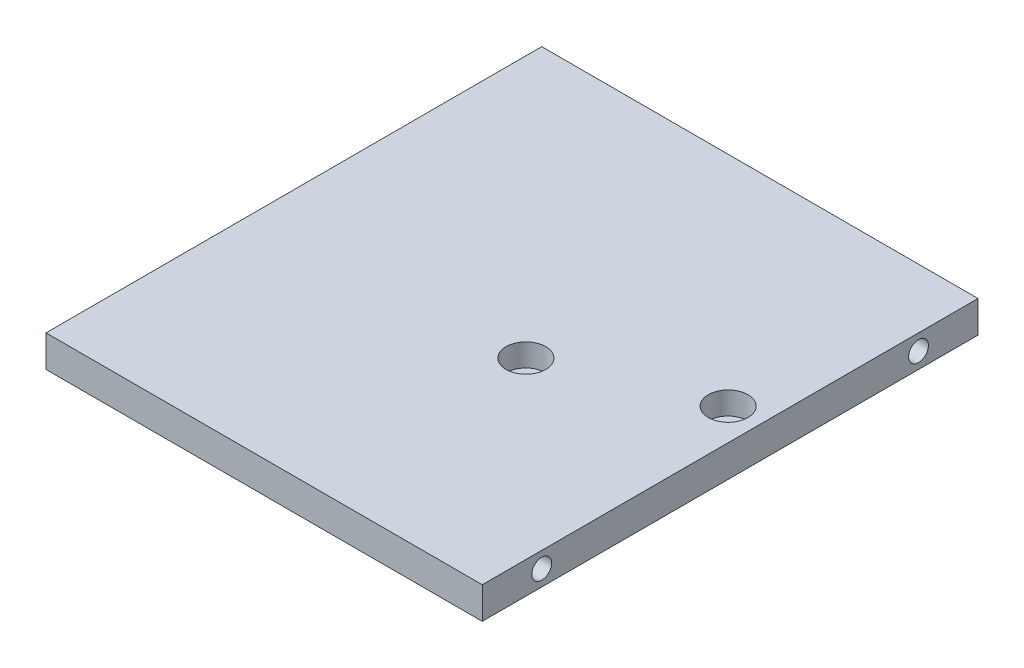
ISO-10303-21;
HEADER;
FILE_DESCRIPTION(('STEP AP214'),'2;1');
FILE_NAME('part.step','',(''),(''),'','','');
FILE_SCHEMA(('AUTOMOTIVE_DESIGN { 1 0 10303 214 1 1 1 1 }'));
ENDSEC;
DATA;
#1=APPLICATION_CONTEXT('core data for automotive mechanical design processes');
#2=APPLICATION_PROTOCOL_DEFINITION('international standard','automotive_design',2000,#1);
#3=PRODUCT_CONTEXT('',#1,'mechanical');
#4=PRODUCT('Part','Part','',(#3));
#5=PRODUCT_RELATED_PRODUCT_CATEGORY('part','',(#4));
#6=PRODUCT_DEFINITION_FORMATION('','',#4);
#7=PRODUCT_DEFINITION_CONTEXT('part definition',#1,'design');
#8=PRODUCT_DEFINITION('design','',#6,#7);
#9=PRODUCT_DEFINITION_SHAPE('','',#8);
#10=(LENGTH_UNIT() NAMED_UNIT(*) SI_UNIT(.MILLI.,.METRE.));
#11=(NAMED_UNIT(*) PLANE_ANGLE_UNIT() SI_UNIT($,.RADIAN.));
#12=(NAMED_UNIT(*) SI_UNIT($,.STERADIAN.) SOLID_ANGLE_UNIT());
#13=UNCERTAINTY_MEASURE_WITH_UNIT(LENGTH_MEASURE(1.E-05),#10,'distance_accuracy_value','');
#14=(GEOMETRIC_REPRESENTATION_CONTEXT(3) GLOBAL_UNCERTAINTY_ASSIGNED_CONTEXT((#13)) GLOBAL_UNIT_ASSIGNED_CONTEXT((#10,
#11,#12)) REPRESENTATION_CONTEXT('',''));
#15=CARTESIAN_POINT('',(0.,0.,0.));
#16=DIRECTION('',(0.,0.,1.));
#17=DIRECTION('',(1.,0.,0.));
#18=AXIS2_PLACEMENT_3D('',#15,#16,#17);
#19=CARTESIAN_POINT('',(11.,0.,7.49999999999999));
#20=DIRECTION('',(0.,1.,0.));
#21=DIRECTION('',(0.,0.,1.));
#22=AXIS2_PLACEMENT_3D('',#19,#20,#21);
#23=CYLINDRICAL_SURFACE('',#22,2.75);
#24=CARTESIAN_POINT('',(11.,0.,7.49999999999999));
#25=DIRECTION('',(0.,1.,0.));
#26=DIRECTION('',(0.,0.,1.));
#27=AXIS2_PLACEMENT_3D('',#24,#25,#26);
#28=CIRCLE('',#27,2.75);
#29=CARTESIAN_POINT('',(11.,0.,10.25));
#30=VERTEX_POINT('',#29);
#31=EDGE_CURVE('E144',#30,#30,#28,.T.);
#32=ORIENTED_EDGE('',*,*,#31,.F.);
#33=EDGE_LOOP('',(#32));
#34=FACE_BOUND('',#33,.T.);
#35=CARTESIAN_POINT('',(11.,2.3,7.49999999999999));
#36=DIRECTION('',(0.,1.,0.));
#37=DIRECTION('',(0.,0.,1.));
#38=AXIS2_PLACEMENT_3D('',#35,#36,#37);
#39=CIRCLE('',#38,2.75);
#40=CARTESIAN_POINT('',(11.,2.3,10.25));
#41=VERTEX_POINT('',#40);
#42=EDGE_CURVE('E37',#41,#41,#39,.F.);
#43=ORIENTED_EDGE('',*,*,#42,.F.);
#44=EDGE_LOOP('',(#43));
#45=FACE_BOUND('',#44,.T.);
#46=ADVANCED_FACE('F33',(#34,#45),#23,.F.);
#47=CARTESIAN_POINT('',(47.,0.,-7.50000000000002));
#48=DIRECTION('',(0.,1.,0.));
#49=DIRECTION('',(0.,0.,1.));
#50=AXIS2_PLACEMENT_3D('',#47,#48,#49);
#51=CYLINDRICAL_SURFACE('',#50,2.75);
#52=CARTESIAN_POINT('',(47.,0.,-7.50000000000002));
#53=DIRECTION('',(0.,1.,0.));
#54=DIRECTION('',(0.,0.,1.));
#55=AXIS2_PLACEMENT_3D('',#52,#53,#54);
#56=CIRCLE('',#55,2.75);
#57=CARTESIAN_POINT('',(47.,0.,-4.75000000000002));
#58=VERTEX_POINT('',#57);
#59=EDGE_CURVE('E103',#58,#58,#56,.T.);
#60=ORIENTED_EDGE('',*,*,#59,.F.);
#61=EDGE_LOOP('',(#60));
#62=FACE_BOUND('',#61,.T.);
#63=CARTESIAN_POINT('',(47.,2.3,-7.50000000000002));
#64=DIRECTION('',(0.,1.,0.));
#65=DIRECTION('',(0.,0.,1.));
#66=AXIS2_PLACEMENT_3D('',#63,#64,#65);
#67=CIRCLE('',#66,2.75);
#68=CARTESIAN_POINT('',(47.,2.3,-4.75000000000002));
#69=VERTEX_POINT('',#68);
#70=EDGE_CURVE('E108',#69,#69,#67,.F.);
#71=ORIENTED_EDGE('',*,*,#70,.F.);
#72=EDGE_LOOP('',(#71));
#73=FACE_BOUND('',#72,.T.);
#74=ADVANCED_FACE('F163',(#62,#73),#51,.F.);
#75=CARTESIAN_POINT('',(55.,8.,-62.5));
#76=DIRECTION('',(-1.,0.,0.));
#77=DIRECTION('',(0.,0.,1.));
#78=AXIS2_PLACEMENT_3D('',#75,#76,#77);
#79=PLANE('',#78);
#80=CARTESIAN_POINT('',(55.,4.,-47.5));
#81=DIRECTION('',(1.,0.,0.));
#82=DIRECTION('',(0.,0.,-1.));
#83=AXIS2_PLACEMENT_3D('',#80,#81,#82);
#84=CIRCLE('',#83,2.5);
#85=CARTESIAN_POINT('',(55.,4.,-50.));
#86=VERTEX_POINT('',#85);
#87=EDGE_CURVE('E133',#86,#86,#84,.T.);
#88=ORIENTED_EDGE('',*,*,#87,.F.);
#89=EDGE_LOOP('',(#88));
#90=FACE_BOUND('',#89,.T.);
#91=CARTESIAN_POINT('',(55.,4.,47.5));
#92=DIRECTION('',(1.,0.,0.));
#93=DIRECTION('',(0.,0.,-1.));
#94=AXIS2_PLACEMENT_3D('',#91,#92,#93);
#95=CIRCLE('',#94,2.49999999999999);
#96=CARTESIAN_POINT('',(55.,4.,45.));
#97=VERTEX_POINT('',#96);
#98=EDGE_CURVE('E114',#97,#97,#95,.T.);
#99=ORIENTED_EDGE('',*,*,#98,.F.);
#100=EDGE_LOOP('',(#99));
#101=FACE_BOUND('',#100,.T.);
#102=DIRECTION('',(0.,0.,-1.));
#103=VECTOR('',#102,1.);
#104=CARTESIAN_POINT('',(55.,0.,-62.5));
#105=LINE('',#104,#103);
#106=CARTESIAN_POINT('',(55.,0.,62.5));
#107=VERTEX_POINT('',#106);
#108=CARTESIAN_POINT('',(55.,0.,-62.5));
#109=VERTEX_POINT('',#108);
#110=EDGE_CURVE('E100',#107,#109,#105,.T.);
#111=ORIENTED_EDGE('',*,*,#110,.T.);
#112=DIRECTION('',(0.,-1.,0.));
#113=VECTOR('',#112,1.);
#114=CARTESIAN_POINT('',(55.,8.,-62.5));
#115=LINE('',#114,#113);
#116=CARTESIAN_POINT('',(55.,8.,-62.5));
#117=VERTEX_POINT('',#116);
#118=EDGE_CURVE('E11',#117,#109,#115,.T.);
#119=ORIENTED_EDGE('',*,*,#118,.F.);
#120=DIRECTION('',(0.,0.,-1.));
#121=VECTOR('',#120,1.);
#122=CARTESIAN_POINT('',(55.,8.,-62.5));
#123=LINE('',#122,#121);
#124=CARTESIAN_POINT('',(55.,8.,62.5));
#125=VERTEX_POINT('',#124);
#126=EDGE_CURVE('E87',#125,#117,#123,.T.);
#127=ORIENTED_EDGE('',*,*,#126,.F.);
#128=DIRECTION('',(0.,-1.,0.));
#129=VECTOR('',#128,1.);
#130=CARTESIAN_POINT('',(55.,8.,62.5));
#131=LINE('',#130,#129);
#132=EDGE_CURVE('E96',#125,#107,#131,.T.);
#133=ORIENTED_EDGE('',*,*,#132,.T.);
#134=EDGE_LOOP('',(#111,#119,#127,#133));
#135=FACE_BOUND('',#134,.T.);
#136=ADVANCED_FACE('F35',(#90,#101,#135),#79,.F.);
#137=CARTESIAN_POINT('',(-55.,8.,-62.5));
#138=DIRECTION('',(0.,0.,1.));
#139=DIRECTION('',(1.,0.,0.));
#140=AXIS2_PLACEMENT_3D('',#137,#138,#139);
#141=PLANE('',#140);
#142=DIRECTION('',(-1.,0.,0.));
#143=VECTOR('',#142,1.);
#144=CARTESIAN_POINT('',(-55.,0.,-62.5));
#145=LINE('',#144,#143);
#146=CARTESIAN_POINT('',(-55.,0.,-62.5));
#147=VERTEX_POINT('',#146);
#148=EDGE_CURVE('E91',#109,#147,#145,.T.);
#149=ORIENTED_EDGE('',*,*,#148,.T.);
#150=DIRECTION('',(0.,-1.,0.));
#151=VECTOR('',#150,1.);
#152=CARTESIAN_POINT('',(-55.,8.,-62.5));
#153=LINE('',#152,#151);
#154=CARTESIAN_POINT('',(-55.,8.,-62.5));
#155=VERTEX_POINT('',#154);
#156=EDGE_CURVE('E43',#155,#147,#153,.T.);
#157=ORIENTED_EDGE('',*,*,#156,.F.);
#158=DIRECTION('',(-1.,0.,0.));
#159=VECTOR('',#158,1.);
#160=CARTESIAN_POINT('',(-55.,8.,-62.5));
#161=LINE('',#160,#159);
#162=EDGE_CURVE('E82',#117,#155,#161,.T.);
#163=ORIENTED_EDGE('',*,*,#162,.F.);
#164=ORIENTED_EDGE('',*,*,#118,.T.);
#165=EDGE_LOOP('',(#149,#157,#163,#164));
#166=FACE_BOUND('',#165,.T.);
#167=ADVANCED_FACE('F90',(#166),#141,.F.);
#168=CARTESIAN_POINT('',(-55.,8.,-62.5));
#169=DIRECTION('',(1.,0.,0.));
#170=DIRECTION('',(0.,0.,-1.));
#171=AXIS2_PLACEMENT_3D('',#168,#169,#170);
#172=PLANE('',#171);
#173=CARTESIAN_POINT('',(-55.,4.,47.5));
#174=DIRECTION('',(-1.,0.,0.));
#175=DIRECTION('',(0.,0.,1.));
#176=AXIS2_PLACEMENT_3D('',#173,#174,#175);
#177=CIRCLE('',#176,2.5);
#178=CARTESIAN_POINT('',(-55.,4.,50.));
#179=VERTEX_POINT('',#178);
#180=EDGE_CURVE('E145',#179,#179,#177,.T.);
#181=ORIENTED_EDGE('',*,*,#180,.F.);
#182=EDGE_LOOP('',(#181));
#183=FACE_BOUND('',#182,.T.);
#184=CARTESIAN_POINT('',(-55.,4.,-47.5));
#185=DIRECTION('',(-1.,0.,0.));
#186=DIRECTION('',(0.,0.,1.));
#187=AXIS2_PLACEMENT_3D('',#184,#185,#186);
#188=CIRCLE('',#187,2.5);
#189=CARTESIAN_POINT('',(-55.,4.,-45.));
#190=VERTEX_POINT('',#189);
#191=EDGE_CURVE('E132',#190,#190,#188,.T.);
#192=ORIENTED_EDGE('',*,*,#191,.F.);
#193=EDGE_LOOP('',(#192));
#194=FACE_BOUND('',#193,.T.);
#195=DIRECTION('',(0.,0.,1.));
#196=VECTOR('',#195,1.);
#197=CARTESIAN_POINT('',(-55.,0.,-62.5));
#198=LINE('',#197,#196);
#199=CARTESIAN_POINT('',(-55.,0.,62.5));
#200=VERTEX_POINT('',#199);
#201=EDGE_CURVE('E69',#147,#200,#198,.T.);
#202=ORIENTED_EDGE('',*,*,#201,.T.);
#203=DIRECTION('',(0.,-1.,0.));
#204=VECTOR('',#203,1.);
#205=CARTESIAN_POINT('',(-55.,8.,62.5));
#206=LINE('',#205,#204);
#207=CARTESIAN_POINT('',(-55.,8.,62.5));
#208=VERTEX_POINT('',#207);
#209=EDGE_CURVE('E92',#208,#200,#206,.T.);
#210=ORIENTED_EDGE('',*,*,#209,.F.);
#211=DIRECTION('',(0.,0.,1.));
#212=VECTOR('',#211,1.);
#213=CARTESIAN_POINT('',(-55.,8.,-62.5));
#214=LINE('',#213,#212);
#215=EDGE_CURVE('E85',#155,#208,#214,.T.);
#216=ORIENTED_EDGE('',*,*,#215,.F.);
#217=ORIENTED_EDGE('',*,*,#156,.T.);
#218=EDGE_LOOP('',(#202,#210,#216,#217));
#219=FACE_BOUND('',#218,.T.);
#220=ADVANCED_FACE('F94',(#183,#194,#219),#172,.F.);
#221=CARTESIAN_POINT('',(-55.,8.,62.5));
#222=DIRECTION('',(0.,0.,-1.));
#223=DIRECTION('',(-1.,0.,0.));
#224=AXIS2_PLACEMENT_3D('',#221,#222,#223);
#225=PLANE('',#224);
#226=DIRECTION('',(1.,0.,0.));
#227=VECTOR('',#226,1.);
#228=CARTESIAN_POINT('',(-55.,0.,62.5));
#229=LINE('',#228,#227);
#230=EDGE_CURVE('E75',#200,#107,#229,.T.);
#231=ORIENTED_EDGE('',*,*,#230,.T.);
#232=ORIENTED_EDGE('',*,*,#132,.F.);
#233=DIRECTION('',(1.,0.,0.));
#234=VECTOR('',#233,1.);
#235=CARTESIAN_POINT('',(-55.,8.,62.5));
#236=LINE('',#235,#234);
#237=EDGE_CURVE('E52',#208,#125,#236,.T.);
#238=ORIENTED_EDGE('',*,*,#237,.F.);
#239=ORIENTED_EDGE('',*,*,#209,.T.);
#240=EDGE_LOOP('',(#231,#232,#238,#239));
#241=FACE_BOUND('',#240,.T.);
#242=ADVANCED_FACE('F222',(#241),#225,.F.);
#243=CARTESIAN_POINT('',(0.,8.,0.));
#244=DIRECTION('',(0.,1.,0.));
#245=DIRECTION('',(0.,0.,1.));
#246=AXIS2_PLACEMENT_3D('',#243,#244,#245);
#247=PLANE('',#246);
#248=CARTESIAN_POINT('',(11.,8.,7.49999999999999));
#249=DIRECTION('',(0.,1.,0.));
#250=DIRECTION('',(0.,0.,1.));
#251=AXIS2_PLACEMENT_3D('',#248,#249,#250);
#252=CIRCLE('',#251,5.);
#253=CARTESIAN_POINT('',(11.,8.,12.5));
#254=VERTEX_POINT('',#253);
#255=EDGE_CURVE('E116',#254,#254,#252,.T.);
#256=ORIENTED_EDGE('',*,*,#255,.F.);
#257=EDGE_LOOP('',(#256));
#258=FACE_BOUND('',#257,.T.);
#259=CARTESIAN_POINT('',(47.,8.,-7.50000000000002));
#260=DIRECTION('',(0.,1.,0.));
#261=DIRECTION('',(0.,0.,1.));
#262=AXIS2_PLACEMENT_3D('',#259,#260,#261);
#263=CIRCLE('',#262,5.);
#264=CARTESIAN_POINT('',(47.,8.,-2.50000000000002));
#265=VERTEX_POINT('',#264);
#266=EDGE_CURVE('E126',#265,#265,#263,.T.);
#267=ORIENTED_EDGE('',*,*,#266,.F.);
#268=EDGE_LOOP('',(#267));
#269=FACE_BOUND('',#268,.T.);
#270=ORIENTED_EDGE('',*,*,#126,.T.);
#271=ORIENTED_EDGE('',*,*,#162,.T.);
#272=ORIENTED_EDGE('',*,*,#215,.T.);
#273=ORIENTED_EDGE('',*,*,#237,.T.);
#274=EDGE_LOOP('',(#270,#271,#272,#273));
#275=FACE_BOUND('',#274,.T.);
#276=ADVANCED_FACE('F83',(#258,#269,#275),#247,.T.);
#277=CARTESIAN_POINT('',(0.,0.,0.));
#278=DIRECTION('',(0.,1.,0.));
#279=DIRECTION('',(0.,0.,1.));
#280=AXIS2_PLACEMENT_3D('',#277,#278,#279);
#281=PLANE('',#280);
#282=ORIENTED_EDGE('',*,*,#59,.T.);
#283=EDGE_LOOP('',(#282));
#284=FACE_BOUND('',#283,.T.);
#285=ORIENTED_EDGE('',*,*,#31,.T.);
#286=EDGE_LOOP('',(#285));
#287=FACE_BOUND('',#286,.T.);
#288=ORIENTED_EDGE('',*,*,#110,.F.);
#289=ORIENTED_EDGE('',*,*,#230,.F.);
#290=ORIENTED_EDGE('',*,*,#201,.F.);
#291=ORIENTED_EDGE('',*,*,#148,.F.);
#292=EDGE_LOOP('',(#288,#289,#290,#291));
#293=FACE_BOUND('',#292,.T.);
#294=ADVANCED_FACE('F158',(#284,#287,#293),#281,.F.);
#295=CARTESIAN_POINT('',(-40.,4.,-47.5));
#296=DIRECTION('',(-1.,0.,0.));
#297=DIRECTION('',(0.,0.,1.));
#298=AXIS2_PLACEMENT_3D('',#295,#296,#297);
#299=CYLINDRICAL_SURFACE('',#298,2.5);
#300=CARTESIAN_POINT('',(-40.,4.,-47.5));
#301=DIRECTION('',(-1.,0.,0.));
#302=DIRECTION('',(0.,0.,1.));
#303=AXIS2_PLACEMENT_3D('',#300,#301,#302);
#304=CIRCLE('',#303,2.5);
#305=CARTESIAN_POINT('',(-40.,4.,-45.));
#306=VERTEX_POINT('',#305);
#307=EDGE_CURVE('E148',#306,#306,#304,.T.);
#308=ORIENTED_EDGE('',*,*,#307,.F.);
#309=EDGE_LOOP('',(#308));
#310=FACE_BOUND('',#309,.T.);
#311=ORIENTED_EDGE('',*,*,#191,.T.);
#312=EDGE_LOOP('',(#311));
#313=FACE_BOUND('',#312,.T.);
#314=ADVANCED_FACE('F212',(#310,#313),#299,.F.);
#315=CARTESIAN_POINT('',(-40.,4.,-47.5));
#316=DIRECTION('',(-1.,0.,0.));
#317=DIRECTION('',(0.,0.,1.));
#318=AXIS2_PLACEMENT_3D('',#315,#316,#317);
#319=PLANE('',#318);
#320=ORIENTED_EDGE('',*,*,#307,.T.);
#321=EDGE_LOOP('',(#320));
#322=FACE_BOUND('',#321,.T.);
#323=ADVANCED_FACE('F208',(#322),#319,.T.);
#324=CARTESIAN_POINT('',(-40.,4.,47.5));
#325=DIRECTION('',(-1.,0.,0.));
#326=DIRECTION('',(0.,0.,1.));
#327=AXIS2_PLACEMENT_3D('',#324,#325,#326);
#328=CYLINDRICAL_SURFACE('',#327,2.5);
#329=CARTESIAN_POINT('',(-40.,4.,47.5));
#330=DIRECTION('',(-1.,0.,0.));
#331=DIRECTION('',(0.,0.,1.));
#332=AXIS2_PLACEMENT_3D('',#329,#330,#331);
#333=CIRCLE('',#332,2.5);
#334=CARTESIAN_POINT('',(-40.,4.,50.));
#335=VERTEX_POINT('',#334);
#336=EDGE_CURVE('E141',#335,#335,#333,.T.);
#337=ORIENTED_EDGE('',*,*,#336,.F.);
#338=EDGE_LOOP('',(#337));
#339=FACE_BOUND('',#338,.T.);
#340=ORIENTED_EDGE('',*,*,#180,.T.);
#341=EDGE_LOOP('',(#340));
#342=FACE_BOUND('',#341,.T.);
#343=ADVANCED_FACE('F204',(#339,#342),#328,.F.);
#344=CARTESIAN_POINT('',(-40.,4.,47.5));
#345=DIRECTION('',(-1.,0.,0.));
#346=DIRECTION('',(0.,0.,1.));
#347=AXIS2_PLACEMENT_3D('',#344,#345,#346);
#348=PLANE('',#347);
#349=ORIENTED_EDGE('',*,*,#336,.T.);
#350=EDGE_LOOP('',(#349));
#351=FACE_BOUND('',#350,.T.);
#352=ADVANCED_FACE('F200',(#351),#348,.T.);
#353=CARTESIAN_POINT('',(40.,4.,47.5));
#354=DIRECTION('',(1.,0.,0.));
#355=DIRECTION('',(0.,0.,-1.));
#356=AXIS2_PLACEMENT_3D('',#353,#354,#355);
#357=CYLINDRICAL_SURFACE('',#356,2.49999999999999);
#358=CARTESIAN_POINT('',(40.,4.,47.5));
#359=DIRECTION('',(1.,0.,0.));
#360=DIRECTION('',(0.,0.,-1.));
#361=AXIS2_PLACEMENT_3D('',#358,#359,#360);
#362=CIRCLE('',#361,2.49999999999999);
#363=CARTESIAN_POINT('',(40.,4.,45.));
#364=VERTEX_POINT('',#363);
#365=EDGE_CURVE('E136',#364,#364,#362,.T.);
#366=ORIENTED_EDGE('',*,*,#365,.F.);
#367=EDGE_LOOP('',(#366));
#368=FACE_BOUND('',#367,.T.);
#369=ORIENTED_EDGE('',*,*,#98,.T.);
#370=EDGE_LOOP('',(#369));
#371=FACE_BOUND('',#370,.T.);
#372=ADVANCED_FACE('F196',(#368,#371),#357,.F.);
#373=CARTESIAN_POINT('',(40.,4.,47.5));
#374=DIRECTION('',(1.,0.,0.));
#375=DIRECTION('',(0.,0.,-1.));
#376=AXIS2_PLACEMENT_3D('',#373,#374,#375);
#377=PLANE('',#376);
#378=ORIENTED_EDGE('',*,*,#365,.T.);
#379=EDGE_LOOP('',(#378));
#380=FACE_BOUND('',#379,.T.);
#381=ADVANCED_FACE('F192',(#380),#377,.T.);
#382=CARTESIAN_POINT('',(40.,4.,-47.5));
#383=DIRECTION('',(1.,0.,0.));
#384=DIRECTION('',(0.,0.,-1.));
#385=AXIS2_PLACEMENT_3D('',#382,#383,#384);
#386=CYLINDRICAL_SURFACE('',#385,2.5);
#387=CARTESIAN_POINT('',(40.,4.,-47.5));
#388=DIRECTION('',(1.,0.,0.));
#389=DIRECTION('',(0.,0.,-1.));
#390=AXIS2_PLACEMENT_3D('',#387,#388,#389);
#391=CIRCLE('',#390,2.5);
#392=CARTESIAN_POINT('',(40.,4.,-50.));
#393=VERTEX_POINT('',#392);
#394=EDGE_CURVE('E129',#393,#393,#391,.T.);
#395=ORIENTED_EDGE('',*,*,#394,.F.);
#396=EDGE_LOOP('',(#395));
#397=FACE_BOUND('',#396,.T.);
#398=ORIENTED_EDGE('',*,*,#87,.T.);
#399=EDGE_LOOP('',(#398));
#400=FACE_BOUND('',#399,.T.);
#401=ADVANCED_FACE('F188',(#397,#400),#386,.F.);
#402=CARTESIAN_POINT('',(40.,4.,-47.5));
#403=DIRECTION('',(1.,0.,0.));
#404=DIRECTION('',(0.,0.,-1.));
#405=AXIS2_PLACEMENT_3D('',#402,#403,#404);
#406=PLANE('',#405);
#407=ORIENTED_EDGE('',*,*,#394,.T.);
#408=EDGE_LOOP('',(#407));
#409=FACE_BOUND('',#408,.T.);
#410=ADVANCED_FACE('F183',(#409),#406,.T.);
#411=CARTESIAN_POINT('',(47.,2.3,-7.50000000000002));
#412=DIRECTION('',(0.,1.,0.));
#413=DIRECTION('',(0.,0.,1.));
#414=AXIS2_PLACEMENT_3D('',#411,#412,#413);
#415=PLANE('',#414);
#416=CARTESIAN_POINT('',(47.,2.3,-7.50000000000002));
#417=DIRECTION('',(0.,1.,0.));
#418=DIRECTION('',(0.,0.,1.));
#419=AXIS2_PLACEMENT_3D('',#416,#417,#418);
#420=CIRCLE('',#419,5.);
#421=CARTESIAN_POINT('',(47.,2.3,-2.50000000000002));
#422=VERTEX_POINT('',#421);
#423=EDGE_CURVE('E121',#422,#422,#420,.T.);
#424=ORIENTED_EDGE('',*,*,#423,.T.);
#425=EDGE_LOOP('',(#424));
#426=FACE_BOUND('',#425,.T.);
#427=ORIENTED_EDGE('',*,*,#70,.T.);
#428=EDGE_LOOP('',(#427));
#429=FACE_BOUND('',#428,.T.);
#430=ADVANCED_FACE('F178',(#426,#429),#415,.T.);
#431=CARTESIAN_POINT('',(47.,2.3,-7.50000000000002));
#432=DIRECTION('',(0.,1.,0.));
#433=DIRECTION('',(0.,0.,1.));
#434=AXIS2_PLACEMENT_3D('',#431,#432,#433);
#435=CYLINDRICAL_SURFACE('',#434,5.);
#436=ORIENTED_EDGE('',*,*,#423,.F.);
#437=EDGE_LOOP('',(#436));
#438=FACE_BOUND('',#437,.T.);
#439=ORIENTED_EDGE('',*,*,#266,.T.);
#440=EDGE_LOOP('',(#439));
#441=FACE_BOUND('',#440,.T.);
#442=ADVANCED_FACE('F170',(#438,#441),#435,.F.);
#443=CARTESIAN_POINT('',(11.,2.3,7.49999999999999));
#444=DIRECTION('',(0.,1.,0.));
#445=DIRECTION('',(0.,0.,1.));
#446=AXIS2_PLACEMENT_3D('',#443,#444,#445);
#447=PLANE('',#446);
#448=CARTESIAN_POINT('',(11.,2.3,7.49999999999999));
#449=DIRECTION('',(0.,1.,0.));
#450=DIRECTION('',(0.,0.,1.));
#451=AXIS2_PLACEMENT_3D('',#448,#449,#450);
#452=CIRCLE('',#451,5.);
#453=CARTESIAN_POINT('',(11.,2.3,12.5));
#454=VERTEX_POINT('',#453);
#455=EDGE_CURVE('E110',#454,#454,#452,.T.);
#456=ORIENTED_EDGE('',*,*,#455,.T.);
#457=EDGE_LOOP('',(#456));
#458=FACE_BOUND('',#457,.T.);
#459=ORIENTED_EDGE('',*,*,#42,.T.);
#460=EDGE_LOOP('',(#459));
#461=FACE_BOUND('',#460,.T.);
#462=ADVANCED_FACE('F167',(#458,#461),#447,.T.);
#463=CARTESIAN_POINT('',(11.,2.3,7.49999999999999));
#464=DIRECTION('',(0.,1.,0.));
#465=DIRECTION('',(0.,0.,1.));
#466=AXIS2_PLACEMENT_3D('',#463,#464,#465);
#467=CYLINDRICAL_SURFACE('',#466,5.);
#468=ORIENTED_EDGE('',*,*,#455,.F.);
#469=EDGE_LOOP('',(#468));
#470=FACE_BOUND('',#469,.T.);
#471=ORIENTED_EDGE('',*,*,#255,.T.);
#472=EDGE_LOOP('',(#471));
#473=FACE_BOUND('',#472,.T.);
#474=ADVANCED_FACE('F169',(#470,#473),#467,.F.);
#475=CLOSED_SHELL('',(#46,#74,#136,#167,#220,#242,#276,#294,#314,#323,#343,#352,#372,#381,#401,
#410,#430,#442,#462,#474));
#476=MANIFOLD_SOLID_BREP('B2',#475);
#477=ADVANCED_BREP_SHAPE_REPRESENTATION('',(#18,#476),#14);
#478=SHAPE_DEFINITION_REPRESENTATION(#9,#477);
ENDSEC;
END-ISO-10303-21;
